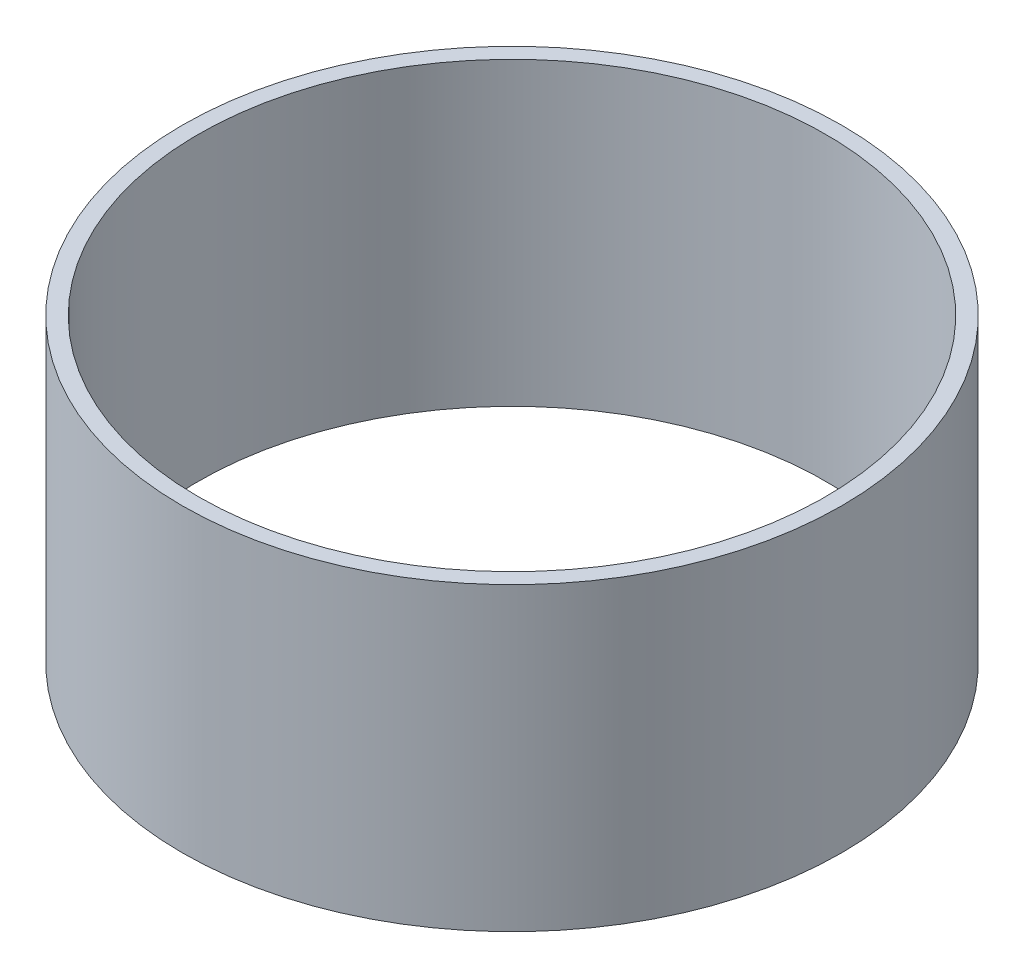
ISO-10303-21;
HEADER;
FILE_DESCRIPTION(('STEP AP214'),'2;1');
FILE_NAME('part.step','',(''),(''),'','','');
FILE_SCHEMA(('AUTOMOTIVE_DESIGN { 1 0 10303 214 1 1 1 1 }'));
ENDSEC;
DATA;
#1=APPLICATION_CONTEXT('core data for automotive mechanical design processes');
#2=APPLICATION_PROTOCOL_DEFINITION('international standard','automotive_design',2000,#1);
#3=PRODUCT_CONTEXT('',#1,'mechanical');
#4=PRODUCT('Part','Part','',(#3));
#5=PRODUCT_RELATED_PRODUCT_CATEGORY('part','',(#4));
#6=PRODUCT_DEFINITION_FORMATION('','',#4);
#7=PRODUCT_DEFINITION_CONTEXT('part definition',#1,'design');
#8=PRODUCT_DEFINITION('design','',#6,#7);
#9=PRODUCT_DEFINITION_SHAPE('','',#8);
#10=(LENGTH_UNIT() NAMED_UNIT(*) SI_UNIT(.MILLI.,.METRE.));
#11=(NAMED_UNIT(*) PLANE_ANGLE_UNIT() SI_UNIT($,.RADIAN.));
#12=(NAMED_UNIT(*) SI_UNIT($,.STERADIAN.) SOLID_ANGLE_UNIT());
#13=UNCERTAINTY_MEASURE_WITH_UNIT(LENGTH_MEASURE(1.E-05),#10,'distance_accuracy_value','');
#14=(GEOMETRIC_REPRESENTATION_CONTEXT(3) GLOBAL_UNCERTAINTY_ASSIGNED_CONTEXT((#13)) GLOBAL_UNIT_ASSIGNED_CONTEXT((#10,
#11,#12)) REPRESENTATION_CONTEXT('',''));
#15=CARTESIAN_POINT('',(0.,0.,0.));
#16=DIRECTION('',(0.,0.,1.));
#17=DIRECTION('',(1.,0.,0.));
#18=AXIS2_PLACEMENT_3D('',#15,#16,#17);
#19=CARTESIAN_POINT('',(0.,670.,0.));
#20=DIRECTION('',(0.,-1.,0.));
#21=DIRECTION('',(0.,0.,-1.));
#22=AXIS2_PLACEMENT_3D('',#19,#20,#21);
#23=CYLINDRICAL_SURFACE('',#22,735.);
#24=CARTESIAN_POINT('',(0.,670.,0.));
#25=DIRECTION('',(0.,1.,0.));
#26=DIRECTION('',(0.,0.,1.));
#27=AXIS2_PLACEMENT_3D('',#24,#25,#26);
#28=CIRCLE('',#27,735.);
#29=CARTESIAN_POINT('',(0.,670.,735.));
#30=VERTEX_POINT('',#29);
#31=EDGE_CURVE('E10',#30,#30,#28,.T.);
#32=ORIENTED_EDGE('',*,*,#31,.F.);
#33=EDGE_LOOP('',(#32));
#34=FACE_BOUND('',#33,.T.);
#35=CARTESIAN_POINT('',(0.,0.,0.));
#36=DIRECTION('',(0.,1.,0.));
#37=DIRECTION('',(0.,0.,1.));
#38=AXIS2_PLACEMENT_3D('',#35,#36,#37);
#39=CIRCLE('',#38,735.);
#40=CARTESIAN_POINT('',(0.,0.,735.));
#41=VERTEX_POINT('',#40);
#42=EDGE_CURVE('E40',#41,#41,#39,.T.);
#43=ORIENTED_EDGE('',*,*,#42,.T.);
#44=EDGE_LOOP('',(#43));
#45=FACE_BOUND('',#44,.T.);
#46=ADVANCED_FACE('F33',(#34,#45),#23,.T.);
#47=CARTESIAN_POINT('',(0.,670.,0.));
#48=DIRECTION('',(0.,1.,0.));
#49=DIRECTION('',(0.,0.,1.));
#50=AXIS2_PLACEMENT_3D('',#47,#48,#49);
#51=PLANE('',#50);
#52=CARTESIAN_POINT('',(0.,670.,0.));
#53=DIRECTION('',(0.,1.,0.));
#54=DIRECTION('',(0.,0.,1.));
#55=AXIS2_PLACEMENT_3D('',#52,#53,#54);
#56=CIRCLE('',#55,699.5);
#57=CARTESIAN_POINT('',(0.,670.,699.5));
#58=VERTEX_POINT('',#57);
#59=EDGE_CURVE('E46',#58,#58,#56,.T.);
#60=ORIENTED_EDGE('',*,*,#59,.F.);
#61=EDGE_LOOP('',(#60));
#62=FACE_BOUND('',#61,.T.);
#63=ORIENTED_EDGE('',*,*,#31,.T.);
#64=EDGE_LOOP('',(#63));
#65=FACE_BOUND('',#64,.T.);
#66=ADVANCED_FACE('F62',(#62,#65),#51,.T.);
#67=CARTESIAN_POINT('',(0.,0.,0.));
#68=DIRECTION('',(0.,1.,0.));
#69=DIRECTION('',(0.,0.,1.));
#70=AXIS2_PLACEMENT_3D('',#67,#68,#69);
#71=PLANE('',#70);
#72=CARTESIAN_POINT('',(0.,0.,0.));
#73=DIRECTION('',(0.,1.,0.));
#74=DIRECTION('',(0.,0.,1.));
#75=AXIS2_PLACEMENT_3D('',#72,#73,#74);
#76=CIRCLE('',#75,699.5);
#77=CARTESIAN_POINT('',(0.,0.,699.5));
#78=VERTEX_POINT('',#77);
#79=EDGE_CURVE('E36',#78,#78,#76,.T.);
#80=ORIENTED_EDGE('',*,*,#79,.T.);
#81=EDGE_LOOP('',(#80));
#82=FACE_BOUND('',#81,.T.);
#83=ORIENTED_EDGE('',*,*,#42,.F.);
#84=EDGE_LOOP('',(#83));
#85=FACE_BOUND('',#84,.T.);
#86=ADVANCED_FACE('F53',(#82,#85),#71,.F.);
#87=CARTESIAN_POINT('',(0.,-2508.,0.));
#88=DIRECTION('',(0.,1.,0.));
#89=DIRECTION('',(0.,0.,1.));
#90=AXIS2_PLACEMENT_3D('',#87,#88,#89);
#91=CYLINDRICAL_SURFACE('',#90,699.5);
#92=ORIENTED_EDGE('',*,*,#59,.T.);
#93=EDGE_LOOP('',(#92));
#94=FACE_BOUND('',#93,.T.);
#95=ORIENTED_EDGE('',*,*,#79,.F.);
#96=EDGE_LOOP('',(#95));
#97=FACE_BOUND('',#96,.T.);
#98=ADVANCED_FACE('F56',(#94,#97),#91,.F.);
#99=CLOSED_SHELL('',(#46,#66,#86,#98));
#100=MANIFOLD_SOLID_BREP('B2',#99);
#101=ADVANCED_BREP_SHAPE_REPRESENTATION('',(#18,#100),#14);
#102=SHAPE_DEFINITION_REPRESENTATION(#9,#101);
ENDSEC;
END-ISO-10303-21;
